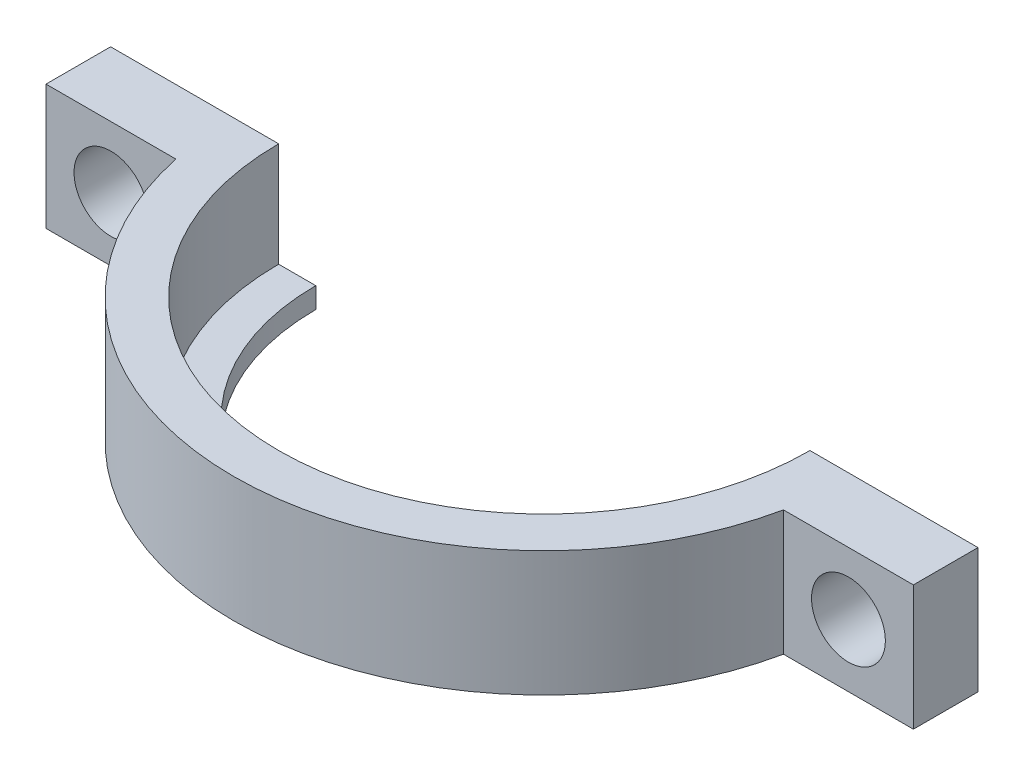
ISO-10303-21;
HEADER;
FILE_DESCRIPTION(('STEP AP214'),'2;1');
FILE_NAME('part.step','',(''),(''),'','','');
FILE_SCHEMA(('AUTOMOTIVE_DESIGN { 1 0 10303 214 1 1 1 1 }'));
ENDSEC;
DATA;
#1=APPLICATION_CONTEXT('core data for automotive mechanical design processes');
#2=APPLICATION_PROTOCOL_DEFINITION('international standard','automotive_design',2000,#1);
#3=PRODUCT_CONTEXT('',#1,'mechanical');
#4=PRODUCT('Part','Part','',(#3));
#5=PRODUCT_RELATED_PRODUCT_CATEGORY('part','',(#4));
#6=PRODUCT_DEFINITION_FORMATION('','',#4);
#7=PRODUCT_DEFINITION_CONTEXT('part definition',#1,'design');
#8=PRODUCT_DEFINITION('design','',#6,#7);
#9=PRODUCT_DEFINITION_SHAPE('','',#8);
#10=(LENGTH_UNIT() NAMED_UNIT(*) SI_UNIT(.MILLI.,.METRE.));
#11=(NAMED_UNIT(*) PLANE_ANGLE_UNIT() SI_UNIT($,.RADIAN.));
#12=(NAMED_UNIT(*) SI_UNIT($,.STERADIAN.) SOLID_ANGLE_UNIT());
#13=UNCERTAINTY_MEASURE_WITH_UNIT(LENGTH_MEASURE(1.E-05),#10,'distance_accuracy_value','');
#14=(GEOMETRIC_REPRESENTATION_CONTEXT(3) GLOBAL_UNCERTAINTY_ASSIGNED_CONTEXT((#13)) GLOBAL_UNIT_ASSIGNED_CONTEXT((#10,
#11,#12)) REPRESENTATION_CONTEXT('',''));
#15=CARTESIAN_POINT('',(0.,0.,0.));
#16=DIRECTION('',(0.,0.,1.));
#17=DIRECTION('',(1.,0.,0.));
#18=AXIS2_PLACEMENT_3D('',#15,#16,#17);
#19=CARTESIAN_POINT('',(-49.7442644411717,0.,0.));
#20=DIRECTION('',(0.,-1.,0.));
#21=DIRECTION('',(0.,0.,-1.));
#22=AXIS2_PLACEMENT_3D('',#19,#20,#21);
#23=CYLINDRICAL_SURFACE('',#22,15.1402673023807);
#24=CARTESIAN_POINT('',(-49.7442644411717,11.7337288164038,0.));
#25=DIRECTION('',(0.,-1.,0.));
#26=DIRECTION('',(0.,0.,-1.));
#27=AXIS2_PLACEMENT_3D('',#24,#25,#26);
#28=CIRCLE('',#27,15.1402673023807);
#29=CARTESIAN_POINT('',(-34.9353078949616,11.7337288164038,3.15000000000001));
#30=VERTEX_POINT('',#29);
#31=CARTESIAN_POINT('',(-64.5532209873817,11.7337288164038,3.15));
#32=VERTEX_POINT('',#31);
#33=EDGE_CURVE('E11',#30,#32,#28,.T.);
#34=ORIENTED_EDGE('',*,*,#33,.T.);
#35=DIRECTION('',(0.,1.,0.));
#36=VECTOR('',#35,1.);
#37=CARTESIAN_POINT('',(-64.5532209873817,-3.29191368207121,3.15));
#38=LINE('',#37,#36);
#39=CARTESIAN_POINT('',(-64.5532209873817,5.63979924945554,3.15));
#40=VERTEX_POINT('',#39);
#41=EDGE_CURVE('E162',#40,#32,#38,.T.);
#42=ORIENTED_EDGE('',*,*,#41,.F.);
#43=CARTESIAN_POINT('',(-49.7442644411717,5.63979924945554,0.));
#44=DIRECTION('',(0.,-1.,0.));
#45=DIRECTION('',(0.,0.,-1.));
#46=AXIS2_PLACEMENT_3D('',#43,#44,#45);
#47=CIRCLE('',#46,15.1402673023807);
#48=CARTESIAN_POINT('',(-34.9353078949616,5.63979924945554,3.15000000000001));
#49=VERTEX_POINT('',#48);
#50=EDGE_CURVE('E55',#49,#40,#47,.T.);
#51=ORIENTED_EDGE('',*,*,#50,.F.);
#52=DIRECTION('',(0.,1.,0.));
#53=VECTOR('',#52,1.);
#54=CARTESIAN_POINT('',(-34.9353078949616,-3.29191368207121,3.15000000000001));
#55=LINE('',#54,#53);
#56=EDGE_CURVE('E174',#49,#30,#55,.T.);
#57=ORIENTED_EDGE('',*,*,#56,.T.);
#58=EDGE_LOOP('',(#34,#42,#51,#57));
#59=FACE_BOUND('',#58,.T.);
#60=ADVANCED_FACE('F45',(#59),#23,.T.);
#61=CARTESIAN_POINT('',(-28.603997138791,-3.29191368207121,3.15000000000001));
#62=DIRECTION('',(1.,0.,0.));
#63=DIRECTION('',(0.,0.,-1.));
#64=AXIS2_PLACEMENT_3D('',#61,#62,#63);
#65=PLANE('',#64);
#66=DIRECTION('',(0.,-1.,0.));
#67=VECTOR('',#66,1.);
#68=CARTESIAN_POINT('',(-28.603997138791,-3.29191368207121,0.));
#69=LINE('',#68,#67);
#70=CARTESIAN_POINT('',(-28.603997138791,11.7337288164038,0.));
#71=VERTEX_POINT('',#70);
#72=CARTESIAN_POINT('',(-28.603997138791,5.63979924945554,0.));
#73=VERTEX_POINT('',#72);
#74=EDGE_CURVE('E217',#71,#73,#69,.T.);
#75=ORIENTED_EDGE('',*,*,#74,.F.);
#76=DIRECTION('',(0.,0.,-1.));
#77=VECTOR('',#76,1.);
#78=CARTESIAN_POINT('',(-28.603997138791,11.7337288164038,3.15000000000001));
#79=LINE('',#78,#77);
#80=CARTESIAN_POINT('',(-28.603997138791,11.7337288164038,3.15000000000001));
#81=VERTEX_POINT('',#80);
#82=EDGE_CURVE('E156',#81,#71,#79,.T.);
#83=ORIENTED_EDGE('',*,*,#82,.F.);
#84=DIRECTION('',(0.,1.,0.));
#85=VECTOR('',#84,1.);
#86=CARTESIAN_POINT('',(-28.603997138791,-3.29191368207121,3.15000000000001));
#87=LINE('',#86,#85);
#88=CARTESIAN_POINT('',(-28.603997138791,5.63979924945554,3.15000000000001));
#89=VERTEX_POINT('',#88);
#90=EDGE_CURVE('E178',#89,#81,#87,.T.);
#91=ORIENTED_EDGE('',*,*,#90,.F.);
#92=DIRECTION('',(0.,0.,1.));
#93=VECTOR('',#92,1.);
#94=CARTESIAN_POINT('',(-28.603997138791,5.63979924945554,3.15000000000001));
#95=LINE('',#94,#93);
#96=EDGE_CURVE('E172',#73,#89,#95,.T.);
#97=ORIENTED_EDGE('',*,*,#96,.F.);
#98=EDGE_LOOP('',(#75,#83,#91,#97));
#99=FACE_BOUND('',#98,.T.);
#100=ADVANCED_FACE('F216',(#99),#65,.T.);
#101=CARTESIAN_POINT('',(-60.8845317435524,6.65067910325642,0.));
#102=DIRECTION('',(0.,-1.,0.));
#103=DIRECTION('',(0.,0.,-1.));
#104=AXIS2_PLACEMENT_3D('',#101,#102,#103);
#105=PLANE('',#104);
#106=CARTESIAN_POINT('',(-49.7442644411717,6.65067910325642,0.));
#107=DIRECTION('',(0.,-1.,0.));
#108=DIRECTION('',(0.,0.,-1.));
#109=AXIS2_PLACEMENT_3D('',#106,#107,#108);
#110=CIRCLE('',#109,12.95);
#111=CARTESIAN_POINT('',(-36.7942644411717,6.65067910325642,0.));
#112=VERTEX_POINT('',#111);
#113=CARTESIAN_POINT('',(-62.6942644411717,6.65067910325642,0.));
#114=VERTEX_POINT('',#113);
#115=EDGE_CURVE('E187',#112,#114,#110,.T.);
#116=ORIENTED_EDGE('',*,*,#115,.F.);
#117=DIRECTION('',(-1.,0.,0.));
#118=VECTOR('',#117,1.);
#119=CARTESIAN_POINT('',(-60.8845317435524,6.65067910325642,0.));
#120=LINE('',#119,#118);
#121=CARTESIAN_POINT('',(-38.603997138791,6.65067910325642,0.));
#122=VERTEX_POINT('',#121);
#123=EDGE_CURVE('E235',#112,#122,#120,.T.);
#124=ORIENTED_EDGE('',*,*,#123,.T.);
#125=CARTESIAN_POINT('',(-49.7442644411717,6.65067910325642,0.));
#126=DIRECTION('',(0.,-1.,0.));
#127=DIRECTION('',(0.,0.,-1.));
#128=AXIS2_PLACEMENT_3D('',#125,#126,#127);
#129=CIRCLE('',#128,11.1402673023807);
#130=CARTESIAN_POINT('',(-60.8845317435524,6.65067910325642,0.));
#131=VERTEX_POINT('',#130);
#132=EDGE_CURVE('E191',#122,#131,#129,.T.);
#133=ORIENTED_EDGE('',*,*,#132,.T.);
#134=EDGE_CURVE('E227',#131,#114,#120,.T.);
#135=ORIENTED_EDGE('',*,*,#134,.T.);
#136=EDGE_LOOP('',(#116,#124,#133,#135));
#137=FACE_BOUND('',#136,.T.);
#138=ADVANCED_FACE('F257',(#137),#105,.F.);
#139=CARTESIAN_POINT('',(-49.7442644411717,0.,0.));
#140=DIRECTION('',(0.,-1.,0.));
#141=DIRECTION('',(0.,0.,-1.));
#142=AXIS2_PLACEMENT_3D('',#139,#140,#141);
#143=CYLINDRICAL_SURFACE('',#142,11.1402673023807);
#144=CARTESIAN_POINT('',(-49.7442644411717,5.63979924945554,0.));
#145=DIRECTION('',(0.,-1.,0.));
#146=DIRECTION('',(0.,0.,-1.));
#147=AXIS2_PLACEMENT_3D('',#144,#145,#146);
#148=CIRCLE('',#147,11.1402673023807);
#149=CARTESIAN_POINT('',(-38.603997138791,5.63979924945554,0.));
#150=VERTEX_POINT('',#149);
#151=CARTESIAN_POINT('',(-60.8845317435524,5.63979924945554,0.));
#152=VERTEX_POINT('',#151);
#153=EDGE_CURVE('E195',#150,#152,#148,.T.);
#154=ORIENTED_EDGE('',*,*,#153,.T.);
#155=DIRECTION('',(0.,-1.,0.));
#156=VECTOR('',#155,1.);
#157=CARTESIAN_POINT('',(-60.8845317435524,0.,0.));
#158=LINE('',#157,#156);
#159=EDGE_CURVE('E221',#152,#131,#158,.F.);
#160=ORIENTED_EDGE('',*,*,#159,.T.);
#161=ORIENTED_EDGE('',*,*,#132,.F.);
#162=DIRECTION('',(0.,-1.,0.));
#163=VECTOR('',#162,1.);
#164=CARTESIAN_POINT('',(-38.603997138791,0.,0.));
#165=LINE('',#164,#163);
#166=EDGE_CURVE('E236',#122,#150,#165,.T.);
#167=ORIENTED_EDGE('',*,*,#166,.T.);
#168=EDGE_LOOP('',(#154,#160,#161,#167));
#169=FACE_BOUND('',#168,.T.);
#170=ADVANCED_FACE('F251',(#169),#143,.F.);
#171=CARTESIAN_POINT('',(-70.8845317435524,-3.29191368207121,-3.15));
#172=DIRECTION('',(-1.,0.,0.));
#173=DIRECTION('',(0.,0.,1.));
#174=AXIS2_PLACEMENT_3D('',#171,#172,#173);
#175=PLANE('',#174);
#176=DIRECTION('',(0.,1.,0.));
#177=VECTOR('',#176,1.);
#178=CARTESIAN_POINT('',(-70.8845317435524,-3.29191368207121,0.));
#179=LINE('',#178,#177);
#180=CARTESIAN_POINT('',(-70.8845317435524,5.63979924945554,0.));
#181=VERTEX_POINT('',#180);
#182=CARTESIAN_POINT('',(-70.8845317435524,11.7337288164038,0.));
#183=VERTEX_POINT('',#182);
#184=EDGE_CURVE('E121',#181,#183,#179,.T.);
#185=ORIENTED_EDGE('',*,*,#184,.F.);
#186=DIRECTION('',(0.,0.,-1.));
#187=VECTOR('',#186,1.);
#188=CARTESIAN_POINT('',(-70.8845317435524,5.63979924945554,-3.15));
#189=LINE('',#188,#187);
#190=CARTESIAN_POINT('',(-70.8845317435524,5.63979924945554,3.15));
#191=VERTEX_POINT('',#190);
#192=EDGE_CURVE('E165',#191,#181,#189,.T.);
#193=ORIENTED_EDGE('',*,*,#192,.F.);
#194=DIRECTION('',(0.,1.,0.));
#195=VECTOR('',#194,1.);
#196=CARTESIAN_POINT('',(-70.8845317435524,-3.29191368207121,3.15));
#197=LINE('',#196,#195);
#198=CARTESIAN_POINT('',(-70.8845317435524,11.7337288164038,3.15));
#199=VERTEX_POINT('',#198);
#200=EDGE_CURVE('E146',#191,#199,#197,.T.);
#201=ORIENTED_EDGE('',*,*,#200,.T.);
#202=DIRECTION('',(0.,0.,1.));
#203=VECTOR('',#202,1.);
#204=CARTESIAN_POINT('',(-70.8845317435524,11.7337288164038,-3.15));
#205=LINE('',#204,#203);
#206=EDGE_CURVE('E137',#183,#199,#205,.T.);
#207=ORIENTED_EDGE('',*,*,#206,.F.);
#208=EDGE_LOOP('',(#185,#193,#201,#207));
#209=FACE_BOUND('',#208,.T.);
#210=ADVANCED_FACE('F144',(#209),#175,.T.);
#211=CARTESIAN_POINT('',(-64.8845317435524,5.63979924945554,0.));
#212=DIRECTION('',(0.,1.,0.));
#213=DIRECTION('',(0.,0.,1.));
#214=AXIS2_PLACEMENT_3D('',#211,#212,#213);
#215=PLANE('',#214);
#216=ORIENTED_EDGE('',*,*,#192,.T.);
#217=DIRECTION('',(1.,0.,0.));
#218=VECTOR('',#217,1.);
#219=CARTESIAN_POINT('',(-64.8845317435524,5.63979924945554,0.));
#220=LINE('',#219,#218);
#221=EDGE_CURVE('E70',#181,#152,#220,.T.);
#222=ORIENTED_EDGE('',*,*,#221,.T.);
#223=ORIENTED_EDGE('',*,*,#153,.F.);
#224=EDGE_CURVE('E220',#150,#73,#220,.T.);
#225=ORIENTED_EDGE('',*,*,#224,.T.);
#226=ORIENTED_EDGE('',*,*,#96,.T.);
#227=DIRECTION('',(-1.,0.,0.));
#228=VECTOR('',#227,1.);
#229=CARTESIAN_POINT('',(-34.9353078949616,5.63979924945554,3.15000000000001));
#230=LINE('',#229,#228);
#231=EDGE_CURVE('E168',#89,#49,#230,.T.);
#232=ORIENTED_EDGE('',*,*,#231,.T.);
#233=ORIENTED_EDGE('',*,*,#50,.T.);
#234=DIRECTION('',(-1.,0.,0.));
#235=VECTOR('',#234,1.);
#236=CARTESIAN_POINT('',(-70.8845317435524,5.63979924945554,3.15));
#237=LINE('',#236,#235);
#238=EDGE_CURVE('E159',#40,#191,#237,.T.);
#239=ORIENTED_EDGE('',*,*,#238,.T.);
#240=EDGE_LOOP('',(#216,#222,#223,#225,#226,#232,#233,#239));
#241=FACE_BOUND('',#240,.T.);
#242=ADVANCED_FACE('F203',(#241),#215,.F.);
#243=CARTESIAN_POINT('',(-62.6942644411717,11.7337288164038,0.));
#244=DIRECTION('',(0.,-1.,0.));
#245=DIRECTION('',(0.,0.,-1.));
#246=AXIS2_PLACEMENT_3D('',#243,#244,#245);
#247=PLANE('',#246);
#248=ORIENTED_EDGE('',*,*,#82,.T.);
#249=DIRECTION('',(-1.,0.,0.));
#250=VECTOR('',#249,1.);
#251=CARTESIAN_POINT('',(-62.6942644411717,11.7337288164038,0.));
#252=LINE('',#251,#250);
#253=CARTESIAN_POINT('',(-36.7942644411717,11.7337288164038,0.));
#254=VERTEX_POINT('',#253);
#255=EDGE_CURVE('E62',#71,#254,#252,.T.);
#256=ORIENTED_EDGE('',*,*,#255,.T.);
#257=CARTESIAN_POINT('',(-49.7442644411717,11.7337288164038,0.));
#258=DIRECTION('',(0.,-1.,0.));
#259=DIRECTION('',(0.,0.,-1.));
#260=AXIS2_PLACEMENT_3D('',#257,#258,#259);
#261=CIRCLE('',#260,12.95);
#262=CARTESIAN_POINT('',(-62.6942644411717,11.7337288164038,0.));
#263=VERTEX_POINT('',#262);
#264=EDGE_CURVE('E140',#254,#263,#261,.T.);
#265=ORIENTED_EDGE('',*,*,#264,.T.);
#266=EDGE_CURVE('E124',#263,#183,#252,.T.);
#267=ORIENTED_EDGE('',*,*,#266,.T.);
#268=ORIENTED_EDGE('',*,*,#206,.T.);
#269=DIRECTION('',(1.,0.,0.));
#270=VECTOR('',#269,1.);
#271=CARTESIAN_POINT('',(-70.8845317435524,11.7337288164038,3.15));
#272=LINE('',#271,#270);
#273=EDGE_CURVE('E149',#199,#32,#272,.T.);
#274=ORIENTED_EDGE('',*,*,#273,.T.);
#275=ORIENTED_EDGE('',*,*,#33,.F.);
#276=DIRECTION('',(1.,0.,0.));
#277=VECTOR('',#276,1.);
#278=CARTESIAN_POINT('',(-34.9353078949616,11.7337288164038,3.15000000000001));
#279=LINE('',#278,#277);
#280=EDGE_CURVE('E150',#30,#81,#279,.T.);
#281=ORIENTED_EDGE('',*,*,#280,.T.);
#282=EDGE_LOOP('',(#248,#256,#265,#267,#268,#274,#275,#281));
#283=FACE_BOUND('',#282,.T.);
#284=ADVANCED_FACE('F47',(#283),#247,.F.);
#285=CARTESIAN_POINT('',(-49.7442644411717,0.,0.));
#286=DIRECTION('',(0.,-1.,0.));
#287=DIRECTION('',(0.,0.,-1.));
#288=AXIS2_PLACEMENT_3D('',#285,#286,#287);
#289=CYLINDRICAL_SURFACE('',#288,12.95);
#290=ORIENTED_EDGE('',*,*,#115,.T.);
#291=DIRECTION('',(0.,-1.,0.));
#292=VECTOR('',#291,1.);
#293=CARTESIAN_POINT('',(-62.6942644411717,0.,0.));
#294=LINE('',#293,#292);
#295=EDGE_CURVE('E142',#114,#263,#294,.F.);
#296=ORIENTED_EDGE('',*,*,#295,.T.);
#297=ORIENTED_EDGE('',*,*,#264,.F.);
#298=DIRECTION('',(0.,-1.,0.));
#299=VECTOR('',#298,1.);
#300=CARTESIAN_POINT('',(-36.7942644411717,0.,0.));
#301=LINE('',#300,#299);
#302=EDGE_CURVE('E231',#254,#112,#301,.T.);
#303=ORIENTED_EDGE('',*,*,#302,.T.);
#304=EDGE_LOOP('',(#290,#296,#297,#303));
#305=FACE_BOUND('',#304,.T.);
#306=ADVANCED_FACE('F298',(#305),#289,.F.);
#307=CARTESIAN_POINT('',(-34.9353078949616,-3.29191368207121,3.15000000000001));
#308=DIRECTION('',(0.,0.,1.));
#309=DIRECTION('',(1.,0.,0.));
#310=AXIS2_PLACEMENT_3D('',#307,#308,#309);
#311=PLANE('',#310);
#312=CARTESIAN_POINT('',(-31.7696525168763,8.68676403292968,3.15000000000002));
#313=DIRECTION('',(0.,0.,1.));
#314=DIRECTION('',(1.,0.,0.));
#315=AXIS2_PLACEMENT_3D('',#312,#313,#314);
#316=CIRCLE('',#315,1.8);
#317=CARTESIAN_POINT('',(-29.9696525168763,8.68676403292968,3.15000000000002));
#318=VERTEX_POINT('',#317);
#319=EDGE_CURVE('E240',#318,#318,#316,.T.);
#320=ORIENTED_EDGE('',*,*,#319,.F.);
#321=EDGE_LOOP('',(#320));
#322=FACE_BOUND('',#321,.T.);
#323=ORIENTED_EDGE('',*,*,#231,.F.);
#324=ORIENTED_EDGE('',*,*,#90,.T.);
#325=ORIENTED_EDGE('',*,*,#280,.F.);
#326=ORIENTED_EDGE('',*,*,#56,.F.);
#327=EDGE_LOOP('',(#323,#324,#325,#326));
#328=FACE_BOUND('',#327,.T.);
#329=ADVANCED_FACE('F212',(#322,#328),#311,.T.);
#330=CARTESIAN_POINT('',(-31.7696525168763,8.68676403292968,-8.24116882454315));
#331=DIRECTION('',(0.,0.,1.));
#332=DIRECTION('',(1.,0.,0.));
#333=AXIS2_PLACEMENT_3D('',#330,#331,#332);
#334=CYLINDRICAL_SURFACE('',#333,1.8);
#335=CARTESIAN_POINT('',(-31.7696525168763,8.68676403292968,0.));
#336=DIRECTION('',(0.,0.,1.));
#337=DIRECTION('',(1.,0.,0.));
#338=AXIS2_PLACEMENT_3D('',#335,#336,#337);
#339=CIRCLE('',#338,1.8);
#340=CARTESIAN_POINT('',(-29.9696525168763,8.68676403292968,0.));
#341=VERTEX_POINT('',#340);
#342=EDGE_CURVE('E49',#341,#341,#339,.F.);
#343=ORIENTED_EDGE('',*,*,#342,.T.);
#344=EDGE_LOOP('',(#343));
#345=FACE_BOUND('',#344,.T.);
#346=ORIENTED_EDGE('',*,*,#319,.T.);
#347=EDGE_LOOP('',(#346));
#348=FACE_BOUND('',#347,.T.);
#349=ADVANCED_FACE('F273',(#345,#348),#334,.F.);
#350=CARTESIAN_POINT('',(-70.8845317435524,-3.29191368207121,3.15));
#351=DIRECTION('',(0.,0.,1.));
#352=DIRECTION('',(1.,0.,0.));
#353=AXIS2_PLACEMENT_3D('',#350,#351,#352);
#354=PLANE('',#353);
#355=CARTESIAN_POINT('',(-67.7188763654671,8.68676403292968,3.15000000000002));
#356=DIRECTION('',(0.,0.,1.));
#357=DIRECTION('',(1.,0.,0.));
#358=AXIS2_PLACEMENT_3D('',#355,#356,#357);
#359=CIRCLE('',#358,1.79999999999999);
#360=CARTESIAN_POINT('',(-65.9188763654671,8.68676403292968,3.15000000000002));
#361=VERTEX_POINT('',#360);
#362=EDGE_CURVE('E173',#361,#361,#359,.T.);
#363=ORIENTED_EDGE('',*,*,#362,.F.);
#364=EDGE_LOOP('',(#363));
#365=FACE_BOUND('',#364,.T.);
#366=ORIENTED_EDGE('',*,*,#238,.F.);
#367=ORIENTED_EDGE('',*,*,#41,.T.);
#368=ORIENTED_EDGE('',*,*,#273,.F.);
#369=ORIENTED_EDGE('',*,*,#200,.F.);
#370=EDGE_LOOP('',(#366,#367,#368,#369));
#371=FACE_BOUND('',#370,.T.);
#372=ADVANCED_FACE('F209',(#365,#371),#354,.T.);
#373=CARTESIAN_POINT('',(-67.7188763654671,8.68676403292968,-8.24116882454315));
#374=DIRECTION('',(0.,0.,1.));
#375=DIRECTION('',(1.,0.,0.));
#376=AXIS2_PLACEMENT_3D('',#373,#374,#375);
#377=CYLINDRICAL_SURFACE('',#376,1.79999999999999);
#378=CARTESIAN_POINT('',(-67.7188763654671,8.68676403292968,0.));
#379=DIRECTION('',(0.,0.,1.));
#380=DIRECTION('',(1.,0.,0.));
#381=AXIS2_PLACEMENT_3D('',#378,#379,#380);
#382=CIRCLE('',#381,1.79999999999999);
#383=CARTESIAN_POINT('',(-65.9188763654671,8.68676403292968,0.));
#384=VERTEX_POINT('',#383);
#385=EDGE_CURVE('E131',#384,#384,#382,.F.);
#386=ORIENTED_EDGE('',*,*,#385,.T.);
#387=EDGE_LOOP('',(#386));
#388=FACE_BOUND('',#387,.T.);
#389=ORIENTED_EDGE('',*,*,#362,.T.);
#390=EDGE_LOOP('',(#389));
#391=FACE_BOUND('',#390,.T.);
#392=ADVANCED_FACE('F277',(#388,#391),#377,.F.);
#393=CARTESIAN_POINT('',(-23.4421170692061,-7.04627118359618,0.));
#394=DIRECTION('',(0.,0.,1.));
#395=DIRECTION('',(1.,0.,0.));
#396=AXIS2_PLACEMENT_3D('',#393,#394,#395);
#397=PLANE('',#396);
#398=ORIENTED_EDGE('',*,*,#342,.F.);
#399=EDGE_LOOP('',(#398));
#400=FACE_BOUND('',#399,.T.);
#401=ORIENTED_EDGE('',*,*,#123,.F.);
#402=ORIENTED_EDGE('',*,*,#302,.F.);
#403=ORIENTED_EDGE('',*,*,#255,.F.);
#404=ORIENTED_EDGE('',*,*,#74,.T.);
#405=ORIENTED_EDGE('',*,*,#224,.F.);
#406=ORIENTED_EDGE('',*,*,#166,.F.);
#407=EDGE_LOOP('',(#401,#402,#403,#404,#405,#406));
#408=FACE_BOUND('',#407,.T.);
#409=ADVANCED_FACE('F254',(#400,#408),#397,.F.);
#410=ORIENTED_EDGE('',*,*,#385,.F.);
#411=EDGE_LOOP('',(#410));
#412=FACE_BOUND('',#411,.T.);
#413=ORIENTED_EDGE('',*,*,#221,.F.);
#414=ORIENTED_EDGE('',*,*,#184,.T.);
#415=ORIENTED_EDGE('',*,*,#266,.F.);
#416=ORIENTED_EDGE('',*,*,#295,.F.);
#417=ORIENTED_EDGE('',*,*,#134,.F.);
#418=ORIENTED_EDGE('',*,*,#159,.F.);
#419=EDGE_LOOP('',(#413,#414,#415,#416,#417,#418));
#420=FACE_BOUND('',#419,.T.);
#421=ADVANCED_FACE('F123',(#412,#420),#397,.F.);
#422=CLOSED_SHELL('',(#60,#100,#138,#170,#210,#242,#284,#306,#329,#349,#372,#392,#409,#421));
#423=MANIFOLD_SOLID_BREP('B2',#422);
#424=ADVANCED_BREP_SHAPE_REPRESENTATION('',(#18,#423),#14);
#425=SHAPE_DEFINITION_REPRESENTATION(#9,#424);
ENDSEC;
END-ISO-10303-21;
